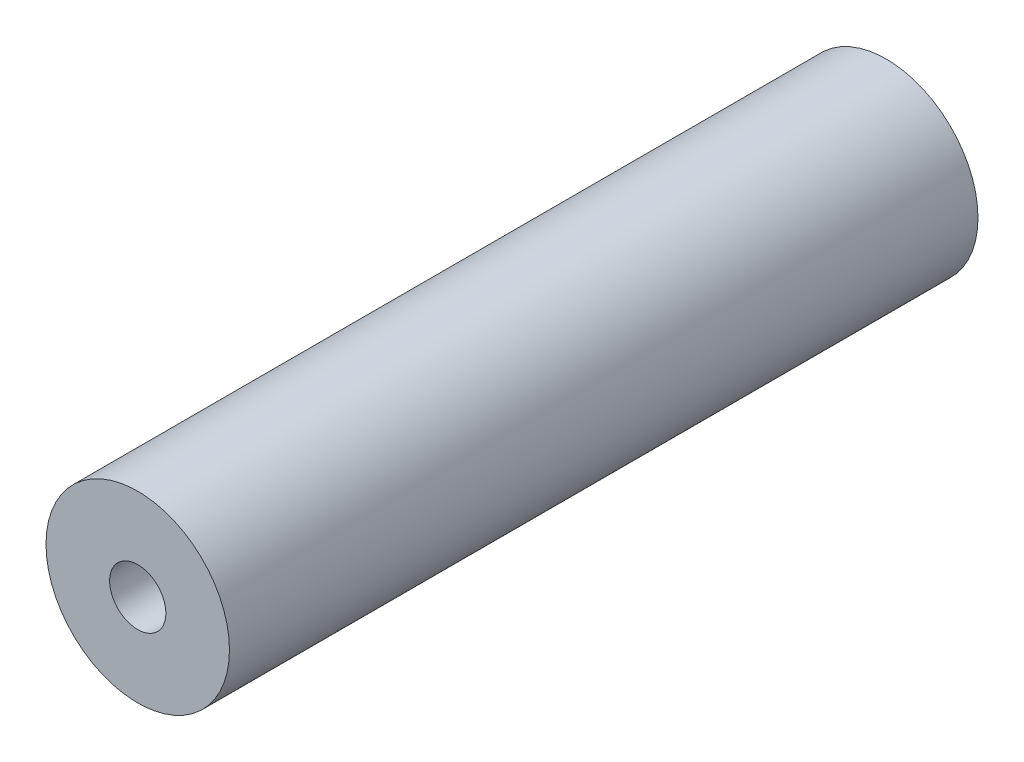
ISO-10303-21;
HEADER;
FILE_DESCRIPTION(('STEP AP214'),'2;1');
FILE_NAME('part.step','',(''),(''),'','','');
FILE_SCHEMA(('AUTOMOTIVE_DESIGN { 1 0 10303 214 1 1 1 1 }'));
ENDSEC;
DATA;
#1=APPLICATION_CONTEXT('core data for automotive mechanical design processes');
#2=APPLICATION_PROTOCOL_DEFINITION('international standard','automotive_design',2000,#1);
#3=PRODUCT_CONTEXT('',#1,'mechanical');
#4=PRODUCT('Part','Part','',(#3));
#5=PRODUCT_RELATED_PRODUCT_CATEGORY('part','',(#4));
#6=PRODUCT_DEFINITION_FORMATION('','',#4);
#7=PRODUCT_DEFINITION_CONTEXT('part definition',#1,'design');
#8=PRODUCT_DEFINITION('design','',#6,#7);
#9=PRODUCT_DEFINITION_SHAPE('','',#8);
#10=(LENGTH_UNIT() NAMED_UNIT(*) SI_UNIT(.MILLI.,.METRE.));
#11=(NAMED_UNIT(*) PLANE_ANGLE_UNIT() SI_UNIT($,.RADIAN.));
#12=(NAMED_UNIT(*) SI_UNIT($,.STERADIAN.) SOLID_ANGLE_UNIT());
#13=UNCERTAINTY_MEASURE_WITH_UNIT(LENGTH_MEASURE(1.E-05),#10,'distance_accuracy_value','');
#14=(GEOMETRIC_REPRESENTATION_CONTEXT(3) GLOBAL_UNCERTAINTY_ASSIGNED_CONTEXT((#13)) GLOBAL_UNIT_ASSIGNED_CONTEXT((#10,
#11,#12)) REPRESENTATION_CONTEXT('',''));
#15=CARTESIAN_POINT('',(0.,0.,0.));
#16=DIRECTION('',(0.,0.,1.));
#17=DIRECTION('',(1.,0.,0.));
#18=AXIS2_PLACEMENT_3D('',#15,#16,#17);
#19=CARTESIAN_POINT('',(20.0025,19.685,92.6));
#20=DIRECTION('',(0.,0.,-1.));
#21=DIRECTION('',(-1.,0.,0.));
#22=AXIS2_PLACEMENT_3D('',#19,#20,#21);
#23=CYLINDRICAL_SURFACE('',#22,9.779);
#24=CARTESIAN_POINT('',(20.0025,19.685,0.));
#25=DIRECTION('',(0.,0.,1.));
#26=DIRECTION('',(1.,0.,0.));
#27=AXIS2_PLACEMENT_3D('',#24,#25,#26);
#28=CIRCLE('',#27,9.779);
#29=CARTESIAN_POINT('',(29.7815,19.685,0.));
#30=VERTEX_POINT('',#29);
#31=EDGE_CURVE('E11',#30,#30,#28,.T.);
#32=ORIENTED_EDGE('',*,*,#31,.T.);
#33=EDGE_LOOP('',(#32));
#34=FACE_BOUND('',#33,.T.);
#35=CARTESIAN_POINT('',(20.0025,19.685,79.7984));
#36=DIRECTION('',(0.,0.,1.));
#37=DIRECTION('',(1.,0.,0.));
#38=AXIS2_PLACEMENT_3D('',#35,#36,#37);
#39=CIRCLE('',#38,9.779);
#40=CARTESIAN_POINT('',(29.7815,19.685,79.7984));
#41=VERTEX_POINT('',#40);
#42=EDGE_CURVE('E39',#41,#41,#39,.T.);
#43=ORIENTED_EDGE('',*,*,#42,.F.);
#44=EDGE_LOOP('',(#43));
#45=FACE_BOUND('',#44,.T.);
#46=ADVANCED_FACE('F36',(#34,#45),#23,.T.);
#47=CARTESIAN_POINT('',(20.0025,19.685,0.));
#48=DIRECTION('',(0.,0.,1.));
#49=DIRECTION('',(1.,0.,0.));
#50=AXIS2_PLACEMENT_3D('',#47,#48,#49);
#51=PLANE('',#50);
#52=ORIENTED_EDGE('',*,*,#31,.F.);
#53=EDGE_LOOP('',(#52));
#54=FACE_BOUND('',#53,.T.);
#55=ADVANCED_FACE('F72',(#54),#51,.F.);
#56=CARTESIAN_POINT('',(20.0025,19.685,79.7984));
#57=DIRECTION('',(0.,0.,1.));
#58=DIRECTION('',(1.,0.,0.));
#59=AXIS2_PLACEMENT_3D('',#56,#57,#58);
#60=PLANE('',#59);
#61=CARTESIAN_POINT('',(20.0025,19.685,79.7984));
#62=DIRECTION('',(0.,0.,1.));
#63=DIRECTION('',(1.,0.,0.));
#64=AXIS2_PLACEMENT_3D('',#61,#62,#63);
#65=CIRCLE('',#64,3.);
#66=CARTESIAN_POINT('',(23.0025,19.685,79.7984));
#67=VERTEX_POINT('',#66);
#68=EDGE_CURVE('E64',#67,#67,#65,.T.);
#69=ORIENTED_EDGE('',*,*,#68,.F.);
#70=EDGE_LOOP('',(#69));
#71=FACE_BOUND('',#70,.T.);
#72=ORIENTED_EDGE('',*,*,#42,.T.);
#73=EDGE_LOOP('',(#72));
#74=FACE_BOUND('',#73,.T.);
#75=ADVANCED_FACE('F49',(#71,#74),#60,.T.);
#76=CARTESIAN_POINT('',(20.0025,19.685,71.3005515475689));
#77=DIRECTION('',(0.,0.,1.));
#78=DIRECTION('',(1.,0.,0.));
#79=AXIS2_PLACEMENT_3D('',#76,#77,#78);
#80=CONICAL_SURFACE('',#79,2.5,1.02974425867666);
#81=CARTESIAN_POINT('',(20.0025,19.685,69.7984));
#82=VERTEX_POINT('',#81);
#83=VERTEX_LOOP('',#82);
#84=FACE_BOUND('',#83,.T.);
#85=CARTESIAN_POINT('',(20.0025,19.685,71.3005515475689));
#86=DIRECTION('',(0.,0.,1.));
#87=DIRECTION('',(1.,0.,0.));
#88=AXIS2_PLACEMENT_3D('',#85,#86,#87);
#89=CIRCLE('',#88,2.5);
#90=CARTESIAN_POINT('',(22.5025,19.685,71.3005515475689));
#91=VERTEX_POINT('',#90);
#92=EDGE_CURVE('E53',#91,#91,#89,.T.);
#93=ORIENTED_EDGE('',*,*,#92,.T.);
#94=EDGE_LOOP('',(#93));
#95=FACE_BOUND('',#94,.T.);
#96=ADVANCED_FACE('F45',(#84,#95),#80,.F.);
#97=CARTESIAN_POINT('',(20.0025,19.685,79.7984));
#98=DIRECTION('',(0.,0.,1.));
#99=DIRECTION('',(1.,0.,0.));
#100=AXIS2_PLACEMENT_3D('',#97,#98,#99);
#101=CYLINDRICAL_SURFACE('',#100,2.5);
#102=ORIENTED_EDGE('',*,*,#92,.F.);
#103=EDGE_LOOP('',(#102));
#104=FACE_BOUND('',#103,.T.);
#105=CARTESIAN_POINT('',(20.0025,19.685,72.7984));
#106=DIRECTION('',(0.,0.,1.));
#107=DIRECTION('',(1.,0.,0.));
#108=AXIS2_PLACEMENT_3D('',#105,#106,#107);
#109=CIRCLE('',#108,2.5);
#110=CARTESIAN_POINT('',(22.5025,19.685,72.7984));
#111=VERTEX_POINT('',#110);
#112=EDGE_CURVE('E55',#111,#111,#109,.T.);
#113=ORIENTED_EDGE('',*,*,#112,.T.);
#114=EDGE_LOOP('',(#113));
#115=FACE_BOUND('',#114,.T.);
#116=ADVANCED_FACE('F48',(#104,#115),#101,.F.);
#117=CARTESIAN_POINT('',(22.5025,19.685,72.7984));
#118=DIRECTION('',(0.,0.,-1.));
#119=DIRECTION('',(-1.,0.,0.));
#120=AXIS2_PLACEMENT_3D('',#117,#118,#119);
#121=PLANE('',#120);
#122=ORIENTED_EDGE('',*,*,#112,.F.);
#123=EDGE_LOOP('',(#122));
#124=FACE_BOUND('',#123,.T.);
#125=CARTESIAN_POINT('',(20.0025,19.685,72.7984));
#126=DIRECTION('',(0.,0.,1.));
#127=DIRECTION('',(1.,0.,0.));
#128=AXIS2_PLACEMENT_3D('',#125,#126,#127);
#129=CIRCLE('',#128,3.);
#130=CARTESIAN_POINT('',(23.0025,19.685,72.7984));
#131=VERTEX_POINT('',#130);
#132=EDGE_CURVE('E59',#131,#131,#129,.T.);
#133=ORIENTED_EDGE('',*,*,#132,.T.);
#134=EDGE_LOOP('',(#133));
#135=FACE_BOUND('',#134,.T.);
#136=ADVANCED_FACE('F88',(#124,#135),#121,.F.);
#137=CARTESIAN_POINT('',(20.0025,19.685,79.7984));
#138=DIRECTION('',(0.,0.,1.));
#139=DIRECTION('',(1.,0.,0.));
#140=AXIS2_PLACEMENT_3D('',#137,#138,#139);
#141=CYLINDRICAL_SURFACE('',#140,3.);
#142=ORIENTED_EDGE('',*,*,#132,.F.);
#143=EDGE_LOOP('',(#142));
#144=FACE_BOUND('',#143,.T.);
#145=ORIENTED_EDGE('',*,*,#68,.T.);
#146=EDGE_LOOP('',(#145));
#147=FACE_BOUND('',#146,.T.);
#148=ADVANCED_FACE('F68',(#144,#147),#141,.F.);
#149=CLOSED_SHELL('',(#46,#55,#75,#96,#116,#136,#148));
#150=MANIFOLD_SOLID_BREP('B2',#149);
#151=ADVANCED_BREP_SHAPE_REPRESENTATION('',(#18,#150),#14);
#152=SHAPE_DEFINITION_REPRESENTATION(#9,#151);
ENDSEC;
END-ISO-10303-21;
